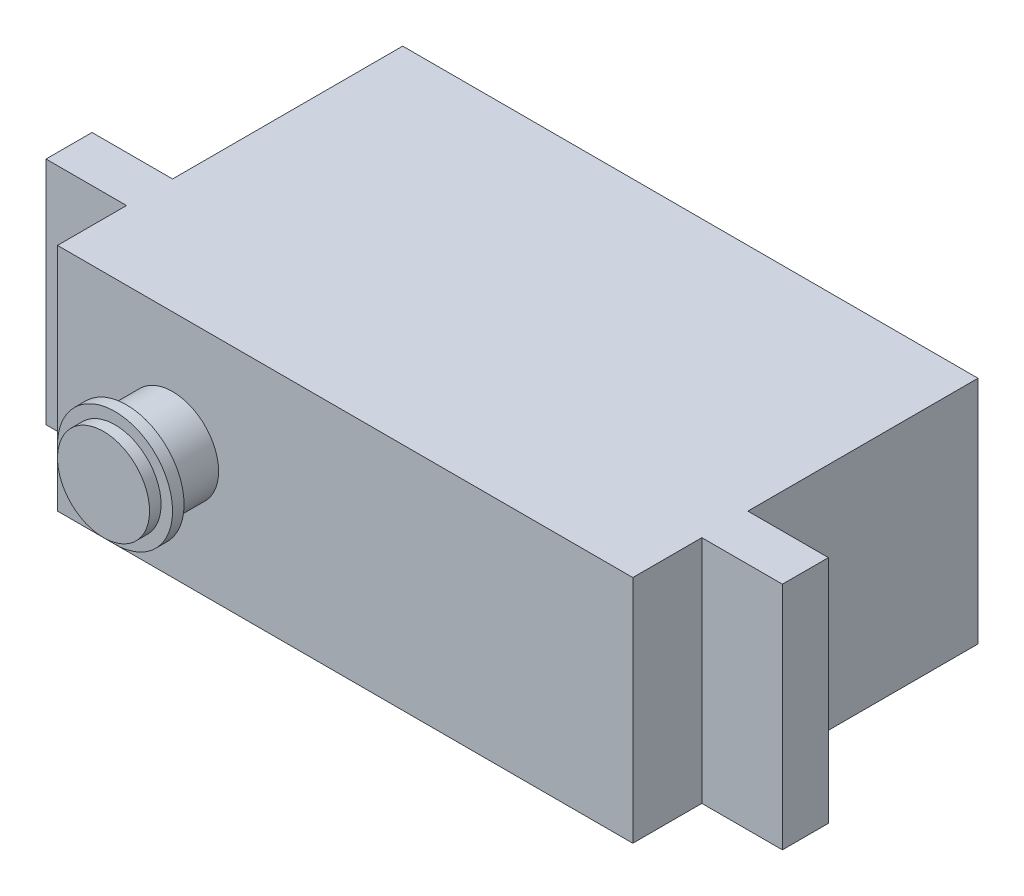
ISO-10303-21;
HEADER;
FILE_DESCRIPTION(('STEP AP214'),'2;1');
FILE_NAME('part.step','',(''),(''),'','','');
FILE_SCHEMA(('AUTOMOTIVE_DESIGN { 1 0 10303 214 1 1 1 1 }'));
ENDSEC;
DATA;
#1=APPLICATION_CONTEXT('core data for automotive mechanical design processes');
#2=APPLICATION_PROTOCOL_DEFINITION('international standard','automotive_design',2000,#1);
#3=PRODUCT_CONTEXT('',#1,'mechanical');
#4=PRODUCT('Part','Part','',(#3));
#5=PRODUCT_RELATED_PRODUCT_CATEGORY('part','',(#4));
#6=PRODUCT_DEFINITION_FORMATION('','',#4);
#7=PRODUCT_DEFINITION_CONTEXT('part definition',#1,'design');
#8=PRODUCT_DEFINITION('design','',#6,#7);
#9=PRODUCT_DEFINITION_SHAPE('','',#8);
#10=(LENGTH_UNIT() NAMED_UNIT(*) SI_UNIT(.MILLI.,.METRE.));
#11=(NAMED_UNIT(*) PLANE_ANGLE_UNIT() SI_UNIT($,.RADIAN.));
#12=(NAMED_UNIT(*) SI_UNIT($,.STERADIAN.) SOLID_ANGLE_UNIT());
#13=UNCERTAINTY_MEASURE_WITH_UNIT(LENGTH_MEASURE(1.E-05),#10,'distance_accuracy_value','');
#14=(GEOMETRIC_REPRESENTATION_CONTEXT(3) GLOBAL_UNCERTAINTY_ASSIGNED_CONTEXT((#13)) GLOBAL_UNIT_ASSIGNED_CONTEXT((#10,
#11,#12)) REPRESENTATION_CONTEXT('',''));
#15=CARTESIAN_POINT('',(0.,0.,0.));
#16=DIRECTION('',(0.,0.,1.));
#17=DIRECTION('',(1.,0.,0.));
#18=AXIS2_PLACEMENT_3D('',#15,#16,#17);
#19=CARTESIAN_POINT('',(-7.5,0.,18.));
#20=DIRECTION('',(0.,0.,-1.));
#21=DIRECTION('',(-1.,0.,0.));
#22=AXIS2_PLACEMENT_3D('',#19,#20,#21);
#23=CYLINDRICAL_SURFACE('',#22,2.);
#24=CARTESIAN_POINT('',(-7.5,0.,15.));
#25=DIRECTION('',(0.,0.,1.));
#26=DIRECTION('',(1.,0.,0.));
#27=AXIS2_PLACEMENT_3D('',#24,#25,#26);
#28=CIRCLE('',#27,2.);
#29=CARTESIAN_POINT('',(-5.5,0.,15.));
#30=VERTEX_POINT('',#29);
#31=EDGE_CURVE('E395',#30,#30,#28,.T.);
#32=ORIENTED_EDGE('',*,*,#31,.T.);
#33=EDGE_LOOP('',(#32));
#34=FACE_BOUND('',#33,.T.);
#35=CARTESIAN_POINT('',(-7.5,0.,17.));
#36=DIRECTION('',(0.,0.,1.));
#37=DIRECTION('',(1.,0.,0.));
#38=AXIS2_PLACEMENT_3D('',#35,#36,#37);
#39=CIRCLE('',#38,2.);
#40=CARTESIAN_POINT('',(-5.5,0.,17.));
#41=VERTEX_POINT('',#40);
#42=EDGE_CURVE('E11',#41,#41,#39,.T.);
#43=ORIENTED_EDGE('',*,*,#42,.F.);
#44=EDGE_LOOP('',(#43));
#45=FACE_BOUND('',#44,.T.);
#46=ADVANCED_FACE('F33',(#34,#45),#23,.T.);
#47=CARTESIAN_POINT('',(-12.5,5.,15.));
#48=DIRECTION('',(1.,0.,0.));
#49=DIRECTION('',(0.,1.,0.));
#50=AXIS2_PLACEMENT_3D('',#47,#48,#49);
#51=PLANE('',#50);
#52=DIRECTION('',(0.,-1.,0.));
#53=VECTOR('',#52,1.);
#54=CARTESIAN_POINT('',(-12.5,5.,10.));
#55=LINE('',#54,#53);
#56=CARTESIAN_POINT('',(-12.5,5.,10.));
#57=VERTEX_POINT('',#56);
#58=CARTESIAN_POINT('',(-12.5,-5.,10.));
#59=VERTEX_POINT('',#58);
#60=EDGE_CURVE('E49',#57,#59,#55,.T.);
#61=ORIENTED_EDGE('',*,*,#60,.F.);
#62=DIRECTION('',(0.,0.,-1.));
#63=VECTOR('',#62,1.);
#64=CARTESIAN_POINT('',(-12.5,5.,15.));
#65=LINE('',#64,#63);
#66=CARTESIAN_POINT('',(-12.5,5.,0.));
#67=VERTEX_POINT('',#66);
#68=EDGE_CURVE('E173',#57,#67,#65,.T.);
#69=ORIENTED_EDGE('',*,*,#68,.T.);
#70=DIRECTION('',(0.,-1.,0.));
#71=VECTOR('',#70,1.);
#72=CARTESIAN_POINT('',(-12.5,5.,0.));
#73=LINE('',#72,#71);
#74=CARTESIAN_POINT('',(-12.5,-5.,0.));
#75=VERTEX_POINT('',#74);
#76=EDGE_CURVE('E393',#67,#75,#73,.T.);
#77=ORIENTED_EDGE('',*,*,#76,.T.);
#78=DIRECTION('',(0.,0.,-1.));
#79=VECTOR('',#78,1.);
#80=CARTESIAN_POINT('',(-12.5,-5.,15.));
#81=LINE('',#80,#79);
#82=EDGE_CURVE('E54',#59,#75,#81,.T.);
#83=ORIENTED_EDGE('',*,*,#82,.F.);
#84=EDGE_LOOP('',(#61,#69,#77,#83));
#85=FACE_BOUND('',#84,.T.);
#86=ADVANCED_FACE('F211',(#85),#51,.F.);
#87=DIRECTION('',(0.,1.,0.));
#88=VECTOR('',#87,1.);
#89=CARTESIAN_POINT('',(-12.5,5.,12.));
#90=LINE('',#89,#88);
#91=CARTESIAN_POINT('',(-12.5,-5.,12.));
#92=VERTEX_POINT('',#91);
#93=CARTESIAN_POINT('',(-12.5,5.,12.));
#94=VERTEX_POINT('',#93);
#95=EDGE_CURVE('E142',#92,#94,#90,.T.);
#96=ORIENTED_EDGE('',*,*,#95,.F.);
#97=CARTESIAN_POINT('',(-12.5,-5.,15.));
#98=VERTEX_POINT('',#97);
#99=EDGE_CURVE('E424',#98,#92,#81,.T.);
#100=ORIENTED_EDGE('',*,*,#99,.F.);
#101=DIRECTION('',(0.,-1.,0.));
#102=VECTOR('',#101,1.);
#103=CARTESIAN_POINT('',(-12.5,5.,15.));
#104=LINE('',#103,#102);
#105=CARTESIAN_POINT('',(-12.5,5.,15.));
#106=VERTEX_POINT('',#105);
#107=EDGE_CURVE('E461',#106,#98,#104,.T.);
#108=ORIENTED_EDGE('',*,*,#107,.F.);
#109=EDGE_CURVE('E417',#106,#94,#65,.T.);
#110=ORIENTED_EDGE('',*,*,#109,.T.);
#111=EDGE_LOOP('',(#96,#100,#108,#110));
#112=FACE_BOUND('',#111,.T.);
#113=ADVANCED_FACE('F219',(#112),#51,.F.);
#114=CARTESIAN_POINT('',(12.5,5.,15.));
#115=DIRECTION('',(-1.,0.,0.));
#116=DIRECTION('',(0.,-1.,0.));
#117=AXIS2_PLACEMENT_3D('',#114,#115,#116);
#118=PLANE('',#117);
#119=DIRECTION('',(0.,-1.,0.));
#120=VECTOR('',#119,1.);
#121=CARTESIAN_POINT('',(12.5,-5.,12.));
#122=LINE('',#121,#120);
#123=CARTESIAN_POINT('',(12.5,5.,12.));
#124=VERTEX_POINT('',#123);
#125=CARTESIAN_POINT('',(12.5,-5.,12.));
#126=VERTEX_POINT('',#125);
#127=EDGE_CURVE('E145',#124,#126,#122,.T.);
#128=ORIENTED_EDGE('',*,*,#127,.F.);
#129=DIRECTION('',(0.,0.,-1.));
#130=VECTOR('',#129,1.);
#131=CARTESIAN_POINT('',(12.5,5.,15.));
#132=LINE('',#131,#130);
#133=CARTESIAN_POINT('',(12.5,5.,15.));
#134=VERTEX_POINT('',#133);
#135=EDGE_CURVE('E42',#134,#124,#132,.T.);
#136=ORIENTED_EDGE('',*,*,#135,.F.);
#137=DIRECTION('',(0.,1.,0.));
#138=VECTOR('',#137,1.);
#139=CARTESIAN_POINT('',(12.5,5.,15.));
#140=LINE('',#139,#138);
#141=CARTESIAN_POINT('',(12.5,-5.,15.));
#142=VERTEX_POINT('',#141);
#143=EDGE_CURVE('E403',#142,#134,#140,.T.);
#144=ORIENTED_EDGE('',*,*,#143,.F.);
#145=DIRECTION('',(0.,0.,-1.));
#146=VECTOR('',#145,1.);
#147=CARTESIAN_POINT('',(12.5,-5.,15.));
#148=LINE('',#147,#146);
#149=EDGE_CURVE('E412',#142,#126,#148,.T.);
#150=ORIENTED_EDGE('',*,*,#149,.T.);
#151=EDGE_LOOP('',(#128,#136,#144,#150));
#152=FACE_BOUND('',#151,.T.);
#153=ADVANCED_FACE('F35',(#152),#118,.F.);
#154=DIRECTION('',(0.,1.,0.));
#155=VECTOR('',#154,1.);
#156=CARTESIAN_POINT('',(12.5,-5.,10.));
#157=LINE('',#156,#155);
#158=CARTESIAN_POINT('',(12.5,-5.,10.));
#159=VERTEX_POINT('',#158);
#160=CARTESIAN_POINT('',(12.5,5.,10.));
#161=VERTEX_POINT('',#160);
#162=EDGE_CURVE('E148',#159,#161,#157,.T.);
#163=ORIENTED_EDGE('',*,*,#162,.F.);
#164=CARTESIAN_POINT('',(12.5,-5.,0.));
#165=VERTEX_POINT('',#164);
#166=EDGE_CURVE('E409',#159,#165,#148,.T.);
#167=ORIENTED_EDGE('',*,*,#166,.T.);
#168=DIRECTION('',(0.,1.,0.));
#169=VECTOR('',#168,1.);
#170=CARTESIAN_POINT('',(12.5,5.,0.));
#171=LINE('',#170,#169);
#172=CARTESIAN_POINT('',(12.5,5.,0.));
#173=VERTEX_POINT('',#172);
#174=EDGE_CURVE('E386',#165,#173,#171,.T.);
#175=ORIENTED_EDGE('',*,*,#174,.T.);
#176=EDGE_CURVE('E414',#161,#173,#132,.T.);
#177=ORIENTED_EDGE('',*,*,#176,.F.);
#178=EDGE_LOOP('',(#163,#167,#175,#177));
#179=FACE_BOUND('',#178,.T.);
#180=ADVANCED_FACE('F310',(#179),#118,.F.);
#181=CARTESIAN_POINT('',(-12.5,5.,15.));
#182=DIRECTION('',(0.,-1.,0.));
#183=DIRECTION('',(0.,0.,-1.));
#184=AXIS2_PLACEMENT_3D('',#181,#182,#183);
#185=PLANE('',#184);
#186=DIRECTION('',(-1.,0.,0.));
#187=VECTOR('',#186,1.);
#188=CARTESIAN_POINT('',(-12.5,5.,0.));
#189=LINE('',#188,#187);
#190=EDGE_CURVE('E390',#173,#67,#189,.T.);
#191=ORIENTED_EDGE('',*,*,#190,.T.);
#192=ORIENTED_EDGE('',*,*,#68,.F.);
#193=DIRECTION('',(1.,0.,0.));
#194=VECTOR('',#193,1.);
#195=CARTESIAN_POINT('',(-16.,5.,10.));
#196=LINE('',#195,#194);
#197=CARTESIAN_POINT('',(-16.,5.,10.));
#198=VERTEX_POINT('',#197);
#199=EDGE_CURVE('E159',#198,#57,#196,.T.);
#200=ORIENTED_EDGE('',*,*,#199,.F.);
#201=DIRECTION('',(0.,0.,-1.));
#202=VECTOR('',#201,1.);
#203=CARTESIAN_POINT('',(-16.,5.,10.));
#204=LINE('',#203,#202);
#205=CARTESIAN_POINT('',(-16.,5.,12.));
#206=VERTEX_POINT('',#205);
#207=EDGE_CURVE('E138',#206,#198,#204,.T.);
#208=ORIENTED_EDGE('',*,*,#207,.F.);
#209=DIRECTION('',(1.,0.,0.));
#210=VECTOR('',#209,1.);
#211=CARTESIAN_POINT('',(-16.,5.,12.));
#212=LINE('',#211,#210);
#213=EDGE_CURVE('E150',#206,#94,#212,.T.);
#214=ORIENTED_EDGE('',*,*,#213,.T.);
#215=ORIENTED_EDGE('',*,*,#109,.F.);
#216=DIRECTION('',(-1.,0.,0.));
#217=VECTOR('',#216,1.);
#218=CARTESIAN_POINT('',(-12.5,5.,15.));
#219=LINE('',#218,#217);
#220=EDGE_CURVE('E460',#134,#106,#219,.T.);
#221=ORIENTED_EDGE('',*,*,#220,.F.);
#222=ORIENTED_EDGE('',*,*,#135,.T.);
#223=DIRECTION('',(-1.,0.,0.));
#224=VECTOR('',#223,1.);
#225=CARTESIAN_POINT('',(16.,5.,12.));
#226=LINE('',#225,#224);
#227=CARTESIAN_POINT('',(16.,5.,12.));
#228=VERTEX_POINT('',#227);
#229=EDGE_CURVE('E428',#228,#124,#226,.T.);
#230=ORIENTED_EDGE('',*,*,#229,.F.);
#231=DIRECTION('',(0.,0.,1.));
#232=VECTOR('',#231,1.);
#233=CARTESIAN_POINT('',(16.,5.,12.));
#234=LINE('',#233,#232);
#235=CARTESIAN_POINT('',(16.,5.,10.));
#236=VERTEX_POINT('',#235);
#237=EDGE_CURVE('E431',#236,#228,#234,.T.);
#238=ORIENTED_EDGE('',*,*,#237,.F.);
#239=DIRECTION('',(-1.,0.,0.));
#240=VECTOR('',#239,1.);
#241=CARTESIAN_POINT('',(16.,5.,10.));
#242=LINE('',#241,#240);
#243=EDGE_CURVE('E430',#236,#161,#242,.T.);
#244=ORIENTED_EDGE('',*,*,#243,.T.);
#245=ORIENTED_EDGE('',*,*,#176,.T.);
#246=EDGE_LOOP('',(#191,#192,#200,#208,#214,#215,#221,#222,#230,#238,#244,#245));
#247=FACE_BOUND('',#246,.T.);
#248=ADVANCED_FACE('F297',(#247),#185,.F.);
#249=CARTESIAN_POINT('',(-12.5,-5.,15.));
#250=DIRECTION('',(0.,1.,0.));
#251=DIRECTION('',(0.,0.,1.));
#252=AXIS2_PLACEMENT_3D('',#249,#250,#251);
#253=PLANE('',#252);
#254=DIRECTION('',(1.,0.,0.));
#255=VECTOR('',#254,1.);
#256=CARTESIAN_POINT('',(-12.5,-5.,0.));
#257=LINE('',#256,#255);
#258=EDGE_CURVE('E388',#75,#165,#257,.T.);
#259=ORIENTED_EDGE('',*,*,#258,.T.);
#260=ORIENTED_EDGE('',*,*,#166,.F.);
#261=DIRECTION('',(-1.,0.,0.));
#262=VECTOR('',#261,1.);
#263=CARTESIAN_POINT('',(16.,-5.,10.));
#264=LINE('',#263,#262);
#265=CARTESIAN_POINT('',(16.,-5.,10.));
#266=VERTEX_POINT('',#265);
#267=EDGE_CURVE('E446',#266,#159,#264,.T.);
#268=ORIENTED_EDGE('',*,*,#267,.F.);
#269=DIRECTION('',(0.,0.,-1.));
#270=VECTOR('',#269,1.);
#271=CARTESIAN_POINT('',(16.,-5.,12.));
#272=LINE('',#271,#270);
#273=CARTESIAN_POINT('',(16.,-5.,12.));
#274=VERTEX_POINT('',#273);
#275=EDGE_CURVE('E472',#274,#266,#272,.T.);
#276=ORIENTED_EDGE('',*,*,#275,.F.);
#277=DIRECTION('',(-1.,0.,0.));
#278=VECTOR('',#277,1.);
#279=CARTESIAN_POINT('',(16.,-5.,12.));
#280=LINE('',#279,#278);
#281=EDGE_CURVE('E451',#274,#126,#280,.T.);
#282=ORIENTED_EDGE('',*,*,#281,.T.);
#283=ORIENTED_EDGE('',*,*,#149,.F.);
#284=DIRECTION('',(1.,0.,0.));
#285=VECTOR('',#284,1.);
#286=CARTESIAN_POINT('',(-12.5,-5.,15.));
#287=LINE('',#286,#285);
#288=EDGE_CURVE('E398',#98,#142,#287,.T.);
#289=ORIENTED_EDGE('',*,*,#288,.F.);
#290=ORIENTED_EDGE('',*,*,#99,.T.);
#291=DIRECTION('',(1.,0.,0.));
#292=VECTOR('',#291,1.);
#293=CARTESIAN_POINT('',(-16.,-5.,12.));
#294=LINE('',#293,#292);
#295=CARTESIAN_POINT('',(-16.,-5.,12.));
#296=VERTEX_POINT('',#295);
#297=EDGE_CURVE('E129',#296,#92,#294,.T.);
#298=ORIENTED_EDGE('',*,*,#297,.F.);
#299=DIRECTION('',(0.,0.,1.));
#300=VECTOR('',#299,1.);
#301=CARTESIAN_POINT('',(-16.,-5.,10.));
#302=LINE('',#301,#300);
#303=CARTESIAN_POINT('',(-16.,-5.,10.));
#304=VERTEX_POINT('',#303);
#305=EDGE_CURVE('E121',#304,#296,#302,.T.);
#306=ORIENTED_EDGE('',*,*,#305,.F.);
#307=DIRECTION('',(1.,0.,0.));
#308=VECTOR('',#307,1.);
#309=CARTESIAN_POINT('',(-16.,-5.,10.));
#310=LINE('',#309,#308);
#311=EDGE_CURVE('E126',#304,#59,#310,.T.);
#312=ORIENTED_EDGE('',*,*,#311,.T.);
#313=ORIENTED_EDGE('',*,*,#82,.T.);
#314=EDGE_LOOP('',(#259,#260,#268,#276,#282,#283,#289,#290,#298,#306,#312,#313));
#315=FACE_BOUND('',#314,.T.);
#316=ADVANCED_FACE('F124',(#315),#253,.F.);
#317=CARTESIAN_POINT('',(0.,0.,15.));
#318=DIRECTION('',(0.,0.,1.));
#319=DIRECTION('',(1.,0.,0.));
#320=AXIS2_PLACEMENT_3D('',#317,#318,#319);
#321=PLANE('',#320);
#322=ORIENTED_EDGE('',*,*,#31,.F.);
#323=EDGE_LOOP('',(#322));
#324=FACE_BOUND('',#323,.T.);
#325=ORIENTED_EDGE('',*,*,#143,.T.);
#326=ORIENTED_EDGE('',*,*,#220,.T.);
#327=ORIENTED_EDGE('',*,*,#107,.T.);
#328=ORIENTED_EDGE('',*,*,#288,.T.);
#329=EDGE_LOOP('',(#325,#326,#327,#328));
#330=FACE_BOUND('',#329,.T.);
#331=ADVANCED_FACE('F296',(#324,#330),#321,.T.);
#332=CARTESIAN_POINT('',(0.,0.,0.));
#333=DIRECTION('',(0.,0.,1.));
#334=DIRECTION('',(1.,0.,0.));
#335=AXIS2_PLACEMENT_3D('',#332,#333,#334);
#336=PLANE('',#335);
#337=ORIENTED_EDGE('',*,*,#174,.F.);
#338=ORIENTED_EDGE('',*,*,#258,.F.);
#339=ORIENTED_EDGE('',*,*,#76,.F.);
#340=ORIENTED_EDGE('',*,*,#190,.F.);
#341=EDGE_LOOP('',(#337,#338,#339,#340));
#342=FACE_BOUND('',#341,.T.);
#343=ADVANCED_FACE('F239',(#342),#336,.F.);
#344=CARTESIAN_POINT('',(16.,-5.,12.));
#345=DIRECTION('',(0.,0.,-1.));
#346=DIRECTION('',(-1.,0.,0.));
#347=AXIS2_PLACEMENT_3D('',#344,#345,#346);
#348=PLANE('',#347);
#349=ORIENTED_EDGE('',*,*,#127,.T.);
#350=ORIENTED_EDGE('',*,*,#281,.F.);
#351=DIRECTION('',(0.,-1.,0.));
#352=VECTOR('',#351,1.);
#353=CARTESIAN_POINT('',(16.,-5.,12.));
#354=LINE('',#353,#352);
#355=EDGE_CURVE('E167',#228,#274,#354,.T.);
#356=ORIENTED_EDGE('',*,*,#355,.F.);
#357=ORIENTED_EDGE('',*,*,#229,.T.);
#358=EDGE_LOOP('',(#349,#350,#356,#357));
#359=FACE_BOUND('',#358,.T.);
#360=ADVANCED_FACE('F236',(#359),#348,.F.);
#361=CARTESIAN_POINT('',(16.,-5.,10.));
#362=DIRECTION('',(0.,0.,1.));
#363=DIRECTION('',(1.,0.,0.));
#364=AXIS2_PLACEMENT_3D('',#361,#362,#363);
#365=PLANE('',#364);
#366=ORIENTED_EDGE('',*,*,#162,.T.);
#367=ORIENTED_EDGE('',*,*,#243,.F.);
#368=DIRECTION('',(0.,1.,0.));
#369=VECTOR('',#368,1.);
#370=CARTESIAN_POINT('',(16.,-5.,10.));
#371=LINE('',#370,#369);
#372=EDGE_CURVE('E471',#266,#236,#371,.T.);
#373=ORIENTED_EDGE('',*,*,#372,.F.);
#374=ORIENTED_EDGE('',*,*,#267,.T.);
#375=EDGE_LOOP('',(#366,#367,#373,#374));
#376=FACE_BOUND('',#375,.T.);
#377=ADVANCED_FACE('F238',(#376),#365,.F.);
#378=CARTESIAN_POINT('',(16.,0.,0.));
#379=DIRECTION('',(-1.,0.,0.));
#380=DIRECTION('',(0.,-1.,0.));
#381=AXIS2_PLACEMENT_3D('',#378,#379,#380);
#382=PLANE('',#381);
#383=ORIENTED_EDGE('',*,*,#355,.T.);
#384=ORIENTED_EDGE('',*,*,#275,.T.);
#385=ORIENTED_EDGE('',*,*,#372,.T.);
#386=ORIENTED_EDGE('',*,*,#237,.T.);
#387=EDGE_LOOP('',(#383,#384,#385,#386));
#388=FACE_BOUND('',#387,.T.);
#389=ADVANCED_FACE('F243',(#388),#382,.F.);
#390=CARTESIAN_POINT('',(-16.,5.,10.));
#391=DIRECTION('',(0.,0.,1.));
#392=DIRECTION('',(0.,-1.,0.));
#393=AXIS2_PLACEMENT_3D('',#390,#391,#392);
#394=PLANE('',#393);
#395=ORIENTED_EDGE('',*,*,#60,.T.);
#396=ORIENTED_EDGE('',*,*,#311,.F.);
#397=DIRECTION('',(0.,-1.,0.));
#398=VECTOR('',#397,1.);
#399=CARTESIAN_POINT('',(-16.,5.,10.));
#400=LINE('',#399,#398);
#401=EDGE_CURVE('E133',#198,#304,#400,.T.);
#402=ORIENTED_EDGE('',*,*,#401,.F.);
#403=ORIENTED_EDGE('',*,*,#199,.T.);
#404=EDGE_LOOP('',(#395,#396,#402,#403));
#405=FACE_BOUND('',#404,.T.);
#406=ADVANCED_FACE('F144',(#405),#394,.F.);
#407=CARTESIAN_POINT('',(-16.,5.,12.));
#408=DIRECTION('',(0.,0.,-1.));
#409=DIRECTION('',(0.,1.,0.));
#410=AXIS2_PLACEMENT_3D('',#407,#408,#409);
#411=PLANE('',#410);
#412=ORIENTED_EDGE('',*,*,#95,.T.);
#413=ORIENTED_EDGE('',*,*,#213,.F.);
#414=DIRECTION('',(0.,1.,0.));
#415=VECTOR('',#414,1.);
#416=CARTESIAN_POINT('',(-16.,5.,12.));
#417=LINE('',#416,#415);
#418=EDGE_CURVE('E132',#296,#206,#417,.T.);
#419=ORIENTED_EDGE('',*,*,#418,.F.);
#420=ORIENTED_EDGE('',*,*,#297,.T.);
#421=EDGE_LOOP('',(#412,#413,#419,#420));
#422=FACE_BOUND('',#421,.T.);
#423=ADVANCED_FACE('F250',(#422),#411,.F.);
#424=CARTESIAN_POINT('',(-16.,0.,0.));
#425=DIRECTION('',(-1.,0.,0.));
#426=DIRECTION('',(0.,-1.,0.));
#427=AXIS2_PLACEMENT_3D('',#424,#425,#426);
#428=PLANE('',#427);
#429=ORIENTED_EDGE('',*,*,#401,.T.);
#430=ORIENTED_EDGE('',*,*,#305,.T.);
#431=ORIENTED_EDGE('',*,*,#418,.T.);
#432=ORIENTED_EDGE('',*,*,#207,.T.);
#433=EDGE_LOOP('',(#429,#430,#431,#432));
#434=FACE_BOUND('',#433,.T.);
#435=ADVANCED_FACE('F136',(#434),#428,.T.);
#436=CARTESIAN_POINT('',(-7.5,0.,17.5));
#437=DIRECTION('',(0.,0.,-1.));
#438=DIRECTION('',(-1.,0.,0.));
#439=AXIS2_PLACEMENT_3D('',#436,#437,#438);
#440=CYLINDRICAL_SURFACE('',#439,2.5);
#441=CARTESIAN_POINT('',(-7.5,0.,17.5));
#442=DIRECTION('',(0.,0.,1.));
#443=DIRECTION('',(1.,0.,0.));
#444=AXIS2_PLACEMENT_3D('',#441,#442,#443);
#445=CIRCLE('',#444,2.5);
#446=CARTESIAN_POINT('',(-5.,0.,17.5));
#447=VERTEX_POINT('',#446);
#448=EDGE_CURVE('E186',#447,#447,#445,.T.);
#449=ORIENTED_EDGE('',*,*,#448,.F.);
#450=EDGE_LOOP('',(#449));
#451=FACE_BOUND('',#450,.T.);
#452=CARTESIAN_POINT('',(-7.5,0.,17.));
#453=DIRECTION('',(0.,0.,1.));
#454=DIRECTION('',(1.,0.,0.));
#455=AXIS2_PLACEMENT_3D('',#452,#453,#454);
#456=CIRCLE('',#455,2.5);
#457=CARTESIAN_POINT('',(-5.,0.,17.));
#458=VERTEX_POINT('',#457);
#459=EDGE_CURVE('E183',#458,#458,#456,.T.);
#460=ORIENTED_EDGE('',*,*,#459,.T.);
#461=EDGE_LOOP('',(#460));
#462=FACE_BOUND('',#461,.T.);
#463=ADVANCED_FACE('F199',(#451,#462),#440,.T.);
#464=CARTESIAN_POINT('',(-7.5,0.,17.5));
#465=DIRECTION('',(0.,0.,1.));
#466=DIRECTION('',(1.,0.,0.));
#467=AXIS2_PLACEMENT_3D('',#464,#465,#466);
#468=PLANE('',#467);
#469=CARTESIAN_POINT('',(-7.5,0.,17.5));
#470=DIRECTION('',(0.,0.,1.));
#471=DIRECTION('',(1.,0.,0.));
#472=AXIS2_PLACEMENT_3D('',#469,#470,#471);
#473=CIRCLE('',#472,2.);
#474=CARTESIAN_POINT('',(-5.5,0.,17.5));
#475=VERTEX_POINT('',#474);
#476=EDGE_CURVE('E37',#475,#475,#473,.T.);
#477=ORIENTED_EDGE('',*,*,#476,.F.);
#478=EDGE_LOOP('',(#477));
#479=FACE_BOUND('',#478,.T.);
#480=ORIENTED_EDGE('',*,*,#448,.T.);
#481=EDGE_LOOP('',(#480));
#482=FACE_BOUND('',#481,.T.);
#483=ADVANCED_FACE('F196',(#479,#482),#468,.T.);
#484=CARTESIAN_POINT('',(-7.5,0.,17.));
#485=DIRECTION('',(0.,0.,1.));
#486=DIRECTION('',(1.,0.,0.));
#487=AXIS2_PLACEMENT_3D('',#484,#485,#486);
#488=PLANE('',#487);
#489=ORIENTED_EDGE('',*,*,#42,.T.);
#490=EDGE_LOOP('',(#489));
#491=FACE_BOUND('',#490,.T.);
#492=ORIENTED_EDGE('',*,*,#459,.F.);
#493=EDGE_LOOP('',(#492));
#494=FACE_BOUND('',#493,.T.);
#495=ADVANCED_FACE('F198',(#491,#494),#488,.F.);
#496=CARTESIAN_POINT('',(-7.5,0.,18.));
#497=DIRECTION('',(0.,0.,1.));
#498=DIRECTION('',(1.,0.,0.));
#499=AXIS2_PLACEMENT_3D('',#496,#497,#498);
#500=PLANE('',#499);
#501=CARTESIAN_POINT('',(-7.5,0.,18.));
#502=DIRECTION('',(0.,0.,1.));
#503=DIRECTION('',(1.,0.,0.));
#504=AXIS2_PLACEMENT_3D('',#501,#502,#503);
#505=CIRCLE('',#504,2.);
#506=CARTESIAN_POINT('',(-5.5,0.,18.));
#507=VERTEX_POINT('',#506);
#508=EDGE_CURVE('E391',#507,#507,#505,.T.);
#509=ORIENTED_EDGE('',*,*,#508,.T.);
#510=EDGE_LOOP('',(#509));
#511=FACE_BOUND('',#510,.T.);
#512=ADVANCED_FACE('F205',(#511),#500,.T.);
#513=ORIENTED_EDGE('',*,*,#476,.T.);
#514=EDGE_LOOP('',(#513));
#515=FACE_BOUND('',#514,.T.);
#516=ORIENTED_EDGE('',*,*,#508,.F.);
#517=EDGE_LOOP('',(#516));
#518=FACE_BOUND('',#517,.T.);
#519=ADVANCED_FACE('F193',(#515,#518),#23,.T.);
#520=CLOSED_SHELL('',(#46,#86,#113,#153,#180,#248,#316,#331,#343,#360,#377,#389,#406,#423,#435,
#463,#483,#495,#512,#519));
#521=MANIFOLD_SOLID_BREP('B2',#520);
#522=ADVANCED_BREP_SHAPE_REPRESENTATION('',(#18,#521),#14);
#523=SHAPE_DEFINITION_REPRESENTATION(#9,#522);
ENDSEC;
END-ISO-10303-21;
